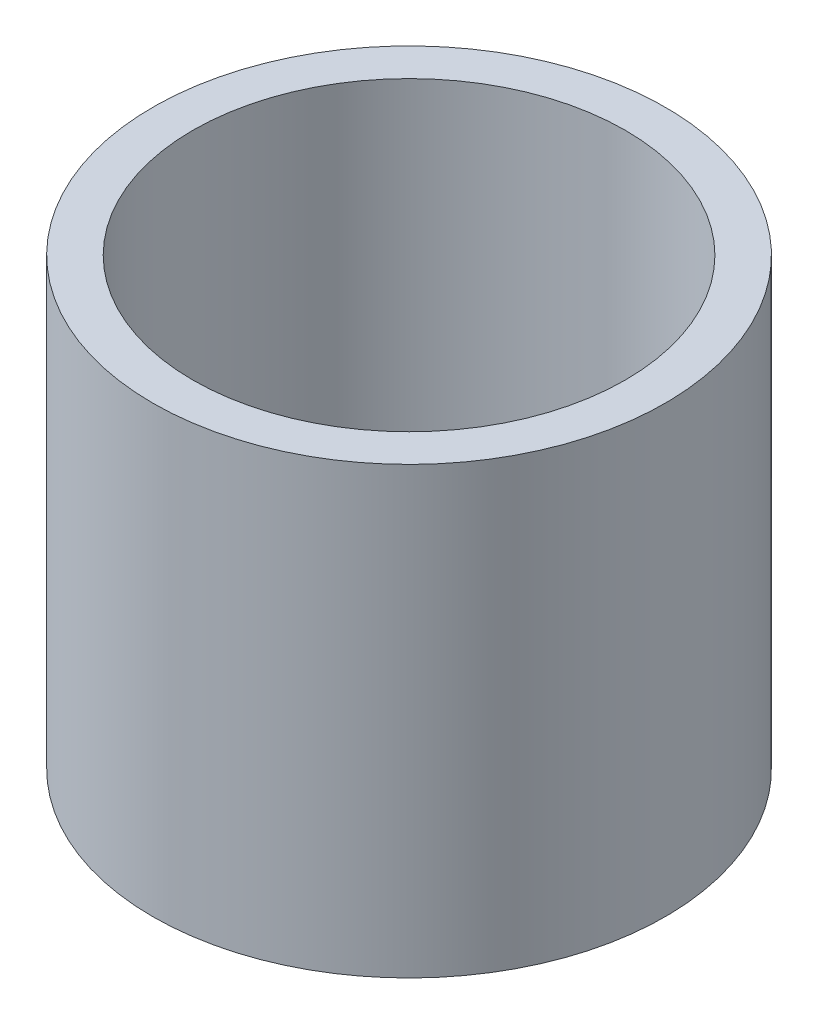
ISO-10303-21;
HEADER;
FILE_DESCRIPTION(('STEP AP214'),'2;1');
FILE_NAME('part.step','',(''),(''),'','','');
FILE_SCHEMA(('AUTOMOTIVE_DESIGN { 1 0 10303 214 1 1 1 1 }'));
ENDSEC;
DATA;
#1=APPLICATION_CONTEXT('core data for automotive mechanical design processes');
#2=APPLICATION_PROTOCOL_DEFINITION('international standard','automotive_design',2000,#1);
#3=PRODUCT_CONTEXT('',#1,'mechanical');
#4=PRODUCT('Part','Part','',(#3));
#5=PRODUCT_RELATED_PRODUCT_CATEGORY('part','',(#4));
#6=PRODUCT_DEFINITION_FORMATION('','',#4);
#7=PRODUCT_DEFINITION_CONTEXT('part definition',#1,'design');
#8=PRODUCT_DEFINITION('design','',#6,#7);
#9=PRODUCT_DEFINITION_SHAPE('','',#8);
#10=(LENGTH_UNIT() NAMED_UNIT(*) SI_UNIT(.MILLI.,.METRE.));
#11=(NAMED_UNIT(*) PLANE_ANGLE_UNIT() SI_UNIT($,.RADIAN.));
#12=(NAMED_UNIT(*) SI_UNIT($,.STERADIAN.) SOLID_ANGLE_UNIT());
#13=UNCERTAINTY_MEASURE_WITH_UNIT(LENGTH_MEASURE(1.E-05),#10,'distance_accuracy_value','');
#14=(GEOMETRIC_REPRESENTATION_CONTEXT(3) GLOBAL_UNCERTAINTY_ASSIGNED_CONTEXT((#13)) GLOBAL_UNIT_ASSIGNED_CONTEXT((#10,
#11,#12)) REPRESENTATION_CONTEXT('',''));
#15=CARTESIAN_POINT('',(0.,0.,0.));
#16=DIRECTION('',(0.,0.,1.));
#17=DIRECTION('',(1.,0.,0.));
#18=AXIS2_PLACEMENT_3D('',#15,#16,#17);
#19=CARTESIAN_POINT('',(0.,47.7283510624971,0.));
#20=DIRECTION('',(0.,-1.,0.));
#21=DIRECTION('',(0.,0.,-1.));
#22=AXIS2_PLACEMENT_3D('',#19,#20,#21);
#23=CYLINDRICAL_SURFACE('',#22,27.5);
#24=CARTESIAN_POINT('',(0.,47.7283510624971,0.));
#25=DIRECTION('',(0.,1.,0.));
#26=DIRECTION('',(0.,0.,1.));
#27=AXIS2_PLACEMENT_3D('',#24,#25,#26);
#28=CIRCLE('',#27,27.5);
#29=CARTESIAN_POINT('',(0.,47.7283510624971,27.5));
#30=VERTEX_POINT('',#29);
#31=EDGE_CURVE('E10',#30,#30,#28,.T.);
#32=ORIENTED_EDGE('',*,*,#31,.F.);
#33=EDGE_LOOP('',(#32));
#34=FACE_BOUND('',#33,.T.);
#35=CARTESIAN_POINT('',(0.,0.,0.));
#36=DIRECTION('',(0.,1.,0.));
#37=DIRECTION('',(0.,0.,1.));
#38=AXIS2_PLACEMENT_3D('',#35,#36,#37);
#39=CIRCLE('',#38,27.5);
#40=CARTESIAN_POINT('',(0.,0.,27.5));
#41=VERTEX_POINT('',#40);
#42=EDGE_CURVE('E37',#41,#41,#39,.T.);
#43=ORIENTED_EDGE('',*,*,#42,.T.);
#44=EDGE_LOOP('',(#43));
#45=FACE_BOUND('',#44,.T.);
#46=ADVANCED_FACE('F40',(#34,#45),#23,.T.);
#47=CARTESIAN_POINT('',(0.,47.7283510624971,0.));
#48=DIRECTION('',(0.,1.,0.));
#49=DIRECTION('',(0.,0.,1.));
#50=AXIS2_PLACEMENT_3D('',#47,#48,#49);
#51=PLANE('',#50);
#52=CARTESIAN_POINT('',(0.,47.7283510624971,0.));
#53=DIRECTION('',(0.,1.,0.));
#54=DIRECTION('',(0.,0.,1.));
#55=AXIS2_PLACEMENT_3D('',#52,#53,#54);
#56=CIRCLE('',#55,23.2089097536997);
#57=CARTESIAN_POINT('',(0.,47.7283510624971,23.2089097536997));
#58=VERTEX_POINT('',#57);
#59=EDGE_CURVE('E50',#58,#58,#56,.T.);
#60=ORIENTED_EDGE('',*,*,#59,.F.);
#61=EDGE_LOOP('',(#60));
#62=FACE_BOUND('',#61,.T.);
#63=ORIENTED_EDGE('',*,*,#31,.T.);
#64=EDGE_LOOP('',(#63));
#65=FACE_BOUND('',#64,.T.);
#66=ADVANCED_FACE('F59',(#62,#65),#51,.T.);
#67=CARTESIAN_POINT('',(0.,0.,0.));
#68=DIRECTION('',(0.,1.,0.));
#69=DIRECTION('',(0.,0.,1.));
#70=AXIS2_PLACEMENT_3D('',#67,#68,#69);
#71=PLANE('',#70);
#72=CARTESIAN_POINT('',(0.,0.,0.));
#73=DIRECTION('',(0.,1.,0.));
#74=DIRECTION('',(0.,0.,1.));
#75=AXIS2_PLACEMENT_3D('',#72,#73,#74);
#76=CIRCLE('',#75,23.2089097536997);
#77=CARTESIAN_POINT('',(0.,0.,23.2089097536997));
#78=VERTEX_POINT('',#77);
#79=EDGE_CURVE('E47',#78,#78,#76,.T.);
#80=ORIENTED_EDGE('',*,*,#79,.T.);
#81=EDGE_LOOP('',(#80));
#82=FACE_BOUND('',#81,.T.);
#83=ORIENTED_EDGE('',*,*,#42,.F.);
#84=EDGE_LOOP('',(#83));
#85=FACE_BOUND('',#84,.T.);
#86=ADVANCED_FACE('F58',(#82,#85),#71,.F.);
#87=CARTESIAN_POINT('',(0.,47.7283510624971,0.));
#88=DIRECTION('',(0.,-1.,0.));
#89=DIRECTION('',(0.,0.,-1.));
#90=AXIS2_PLACEMENT_3D('',#87,#88,#89);
#91=CYLINDRICAL_SURFACE('',#90,23.2089097536997);
#92=ORIENTED_EDGE('',*,*,#59,.T.);
#93=EDGE_LOOP('',(#92));
#94=FACE_BOUND('',#93,.T.);
#95=ORIENTED_EDGE('',*,*,#79,.F.);
#96=EDGE_LOOP('',(#95));
#97=FACE_BOUND('',#96,.T.);
#98=ADVANCED_FACE('F54',(#94,#97),#91,.F.);
#99=CLOSED_SHELL('',(#46,#66,#86,#98));
#100=MANIFOLD_SOLID_BREP('B2',#99);
#101=ADVANCED_BREP_SHAPE_REPRESENTATION('',(#18,#100),#14);
#102=SHAPE_DEFINITION_REPRESENTATION(#9,#101);
ENDSEC;
END-ISO-10303-21;
